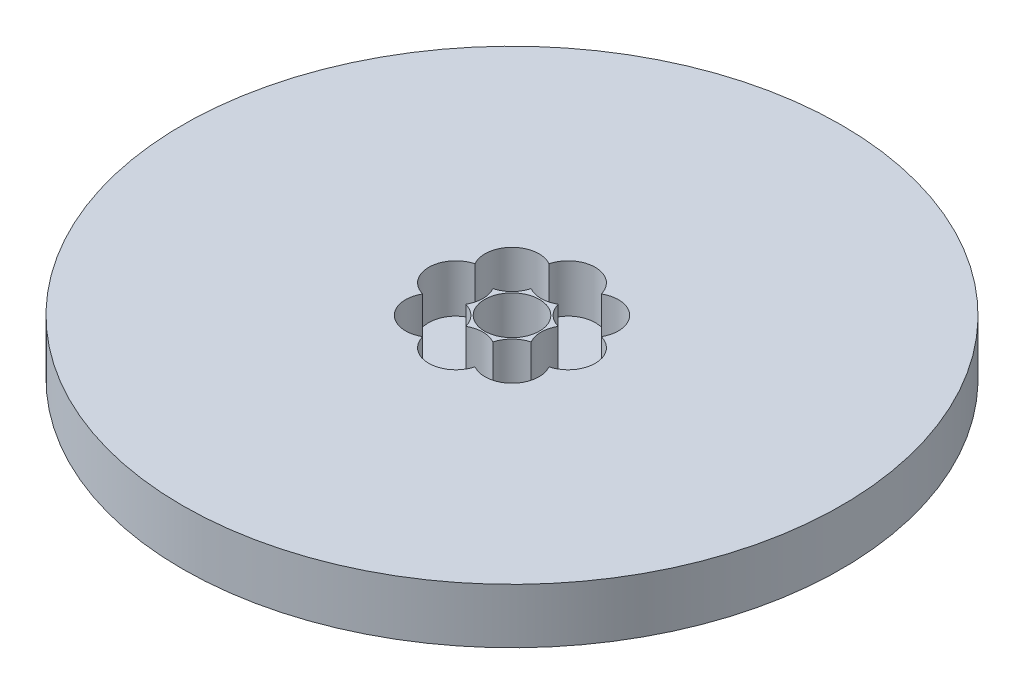
ISO-10303-21;
HEADER;
FILE_DESCRIPTION(('STEP AP214'),'2;1');
FILE_NAME('part.step','',(''),(''),'','','');
FILE_SCHEMA(('AUTOMOTIVE_DESIGN { 1 0 10303 214 1 1 1 1 }'));
ENDSEC;
DATA;
#1=APPLICATION_CONTEXT('core data for automotive mechanical design processes');
#2=APPLICATION_PROTOCOL_DEFINITION('international standard','automotive_design',2000,#1);
#3=PRODUCT_CONTEXT('',#1,'mechanical');
#4=PRODUCT('Part','Part','',(#3));
#5=PRODUCT_RELATED_PRODUCT_CATEGORY('part','',(#4));
#6=PRODUCT_DEFINITION_FORMATION('','',#4);
#7=PRODUCT_DEFINITION_CONTEXT('part definition',#1,'design');
#8=PRODUCT_DEFINITION('design','',#6,#7);
#9=PRODUCT_DEFINITION_SHAPE('','',#8);
#10=(LENGTH_UNIT() NAMED_UNIT(*) SI_UNIT(.MILLI.,.METRE.));
#11=(NAMED_UNIT(*) PLANE_ANGLE_UNIT() SI_UNIT($,.RADIAN.));
#12=(NAMED_UNIT(*) SI_UNIT($,.STERADIAN.) SOLID_ANGLE_UNIT());
#13=UNCERTAINTY_MEASURE_WITH_UNIT(LENGTH_MEASURE(1.E-05),#10,'distance_accuracy_value','');
#14=(GEOMETRIC_REPRESENTATION_CONTEXT(3) GLOBAL_UNCERTAINTY_ASSIGNED_CONTEXT((#13)) GLOBAL_UNIT_ASSIGNED_CONTEXT((#10,
#11,#12)) REPRESENTATION_CONTEXT('',''));
#15=CARTESIAN_POINT('',(0.,0.,0.));
#16=DIRECTION('',(0.,0.,1.));
#17=DIRECTION('',(1.,0.,0.));
#18=AXIS2_PLACEMENT_3D('',#15,#16,#17);
#19=CARTESIAN_POINT('',(0.,10.,0.));
#20=DIRECTION('',(0.,1.,0.));
#21=DIRECTION('',(0.,0.,1.));
#22=AXIS2_PLACEMENT_3D('',#19,#20,#21);
#23=PLANE('',#22);
#24=CARTESIAN_POINT('',(-7.22809447088071,10.,7.22809447088074));
#25=DIRECTION('',(0.,1.,0.));
#26=DIRECTION('',(0.707106781186549,0.,0.707106781186546));
#27=AXIS2_PLACEMENT_3D('',#24,#25,#26);
#28=CIRCLE('',#27,4.93118737523776);
#29=CARTESIAN_POINT('',(-2.46508521943811,10.,5.95124216917298));
#30=VERTEX_POINT('',#29);
#31=CARTESIAN_POINT('',(-5.95124216917297,10.,2.46508521943813));
#32=VERTEX_POINT('',#31);
#33=EDGE_CURVE('E249',#30,#32,#28,.T.);
#34=ORIENTED_EDGE('',*,*,#33,.F.);
#35=CARTESIAN_POINT('',(0.,10.,10.2220692308335));
#36=DIRECTION('',(0.,1.,0.));
#37=DIRECTION('',(1.,0.,0.));
#38=AXIS2_PLACEMENT_3D('',#35,#36,#37);
#39=CIRCLE('',#38,4.93118737523776);
#40=CARTESIAN_POINT('',(2.46508521943815,10.,5.95124216917296));
#41=VERTEX_POINT('',#40);
#42=EDGE_CURVE('E227',#41,#30,#39,.T.);
#43=ORIENTED_EDGE('',*,*,#42,.F.);
#44=CARTESIAN_POINT('',(7.22809447088076,10.,7.22809447088069));
#45=DIRECTION('',(0.,1.,0.));
#46=DIRECTION('',(0.707106781186544,0.,-0.707106781186551));
#47=AXIS2_PLACEMENT_3D('',#44,#45,#46);
#48=CIRCLE('',#47,4.93118737523776);
#49=CARTESIAN_POINT('',(5.95124216917295,10.,2.4650852194381));
#50=VERTEX_POINT('',#49);
#51=EDGE_CURVE('E202',#50,#41,#48,.T.);
#52=ORIENTED_EDGE('',*,*,#51,.F.);
#53=CARTESIAN_POINT('',(10.2220692308335,10.,0.));
#54=DIRECTION('',(0.,1.,0.));
#55=DIRECTION('',(0.,0.,-1.));
#56=AXIS2_PLACEMENT_3D('',#53,#54,#55);
#57=CIRCLE('',#56,4.93118737523776);
#58=CARTESIAN_POINT('',(5.95124216917299,10.,-2.46508521943816));
#59=VERTEX_POINT('',#58);
#60=EDGE_CURVE('E210',#59,#50,#57,.T.);
#61=ORIENTED_EDGE('',*,*,#60,.F.);
#62=CARTESIAN_POINT('',(7.22809447088066,10.,-7.22809447088079));
#63=DIRECTION('',(0.,1.,0.));
#64=DIRECTION('',(-0.707106781186554,0.,-0.707106781186541));
#65=AXIS2_PLACEMENT_3D('',#62,#63,#64);
#66=CIRCLE('',#65,4.93118737523776);
#67=CARTESIAN_POINT('',(2.46508521943807,10.,-5.951242169173));
#68=VERTEX_POINT('',#67);
#69=EDGE_CURVE('E190',#68,#59,#66,.T.);
#70=ORIENTED_EDGE('',*,*,#69,.F.);
#71=CARTESIAN_POINT('',(-1.07070491891453E-13,10.,-10.2220692308335));
#72=DIRECTION('',(0.,1.,0.));
#73=DIRECTION('',(-1.,0.,0.));
#74=AXIS2_PLACEMENT_3D('',#71,#72,#73);
#75=CIRCLE('',#74,4.93118737523776);
#76=CARTESIAN_POINT('',(-2.46508521943819,10.,-5.95124216917295));
#77=VERTEX_POINT('',#76);
#78=EDGE_CURVE('E164',#77,#68,#75,.T.);
#79=ORIENTED_EDGE('',*,*,#78,.F.);
#80=CARTESIAN_POINT('',(-7.22809447088081,10.,-7.22809447088064));
#81=DIRECTION('',(0.,1.,0.));
#82=DIRECTION('',(-0.707106781186539,0.,0.707106781186556));
#83=AXIS2_PLACEMENT_3D('',#80,#81,#82);
#84=CIRCLE('',#83,4.93118737523776);
#85=CARTESIAN_POINT('',(-5.95124216917293,10.,-2.46508521943806));
#86=VERTEX_POINT('',#85);
#87=EDGE_CURVE('E185',#86,#77,#84,.T.);
#88=ORIENTED_EDGE('',*,*,#87,.F.);
#89=CARTESIAN_POINT('',(-10.2220692308335,10.,0.));
#90=DIRECTION('',(0.,1.,0.));
#91=DIRECTION('',(0.,0.,1.));
#92=AXIS2_PLACEMENT_3D('',#89,#90,#91);
#93=CIRCLE('',#92,4.93118737523776);
#94=EDGE_CURVE('E262',#32,#86,#93,.T.);
#95=ORIENTED_EDGE('',*,*,#94,.F.);
#96=EDGE_LOOP('',(#34,#43,#52,#61,#70,#79,#88,#95));
#97=FACE_BOUND('',#96,.T.);
#98=CARTESIAN_POINT('',(0.,10.,0.));
#99=DIRECTION('',(0.,1.,0.));
#100=DIRECTION('',(0.,0.,1.));
#101=AXIS2_PLACEMENT_3D('',#98,#99,#100);
#102=CIRCLE('',#101,5.);
#103=CARTESIAN_POINT('',(0.,10.,5.));
#104=VERTEX_POINT('',#103);
#105=EDGE_CURVE('E270',#104,#104,#102,.T.);
#106=ORIENTED_EDGE('',*,*,#105,.F.);
#107=EDGE_LOOP('',(#106));
#108=FACE_BOUND('',#107,.T.);
#109=ADVANCED_FACE('F39',(#97,#108),#23,.T.);
#110=CARTESIAN_POINT('',(-10.2220692308335,1.27089405824533,0.));
#111=DIRECTION('',(0.,1.,0.));
#112=DIRECTION('',(0.,0.,1.));
#113=AXIS2_PLACEMENT_3D('',#110,#111,#112);
#114=CYLINDRICAL_SURFACE('',#113,4.93118737523776);
#115=CARTESIAN_POINT('',(-10.2220692308335,1.27089405824533,0.));
#116=DIRECTION('',(0.,1.,0.));
#117=DIRECTION('',(0.,0.,1.));
#118=AXIS2_PLACEMENT_3D('',#115,#116,#117);
#119=CIRCLE('',#118,4.93118737523776);
#120=CARTESIAN_POINT('',(-5.95124216917297,1.27089405824533,2.46508521943813));
#121=VERTEX_POINT('',#120);
#122=CARTESIAN_POINT('',(-5.95124216917293,1.27089405824533,-2.46508521943806));
#123=VERTEX_POINT('',#122);
#124=EDGE_CURVE('E259',#121,#123,#119,.T.);
#125=ORIENTED_EDGE('',*,*,#124,.F.);
#126=DIRECTION('',(0.,1.,0.));
#127=VECTOR('',#126,1.);
#128=CARTESIAN_POINT('',(-5.95124216917297,5.63544702912266,2.46508521943813));
#129=LINE('',#128,#127);
#130=EDGE_CURVE('E254',#121,#32,#129,.T.);
#131=ORIENTED_EDGE('',*,*,#130,.T.);
#132=ORIENTED_EDGE('',*,*,#94,.T.);
#133=DIRECTION('',(0.,1.,0.));
#134=VECTOR('',#133,1.);
#135=CARTESIAN_POINT('',(-5.95124216917293,5.63544702912266,-2.46508521943806));
#136=LINE('',#135,#134);
#137=EDGE_CURVE('E247',#86,#123,#136,.F.);
#138=ORIENTED_EDGE('',*,*,#137,.T.);
#139=EDGE_LOOP('',(#125,#131,#132,#138));
#140=FACE_BOUND('',#139,.T.);
#141=ADVANCED_FACE('F287',(#140),#114,.F.);
#142=CARTESIAN_POINT('',(0.,10.,0.));
#143=DIRECTION('',(0.,-1.,0.));
#144=DIRECTION('',(0.,0.,-1.));
#145=AXIS2_PLACEMENT_3D('',#142,#143,#144);
#146=CYLINDRICAL_SURFACE('',#145,60.);
#147=CARTESIAN_POINT('',(0.,10.,0.));
#148=DIRECTION('',(0.,1.,0.));
#149=DIRECTION('',(0.,0.,1.));
#150=AXIS2_PLACEMENT_3D('',#147,#148,#149);
#151=CIRCLE('',#150,60.);
#152=CARTESIAN_POINT('',(0.,10.,60.));
#153=VERTEX_POINT('',#152);
#154=EDGE_CURVE('E11',#153,#153,#151,.T.);
#155=ORIENTED_EDGE('',*,*,#154,.F.);
#156=EDGE_LOOP('',(#155));
#157=FACE_BOUND('',#156,.T.);
#158=CARTESIAN_POINT('',(0.,0.,0.));
#159=DIRECTION('',(0.,1.,0.));
#160=DIRECTION('',(0.,0.,1.));
#161=AXIS2_PLACEMENT_3D('',#158,#159,#160);
#162=CIRCLE('',#161,60.);
#163=CARTESIAN_POINT('',(0.,0.,60.));
#164=VERTEX_POINT('',#163);
#165=EDGE_CURVE('E43',#164,#164,#162,.T.);
#166=ORIENTED_EDGE('',*,*,#165,.T.);
#167=EDGE_LOOP('',(#166));
#168=FACE_BOUND('',#167,.T.);
#169=ADVANCED_FACE('F41',(#157,#168),#146,.T.);
#170=CARTESIAN_POINT('',(-11.4989215325412,10.,4.76300925144261));
#171=VERTEX_POINT('',#170);
#172=CARTESIAN_POINT('',(-4.76300925144257,10.,11.4989215325413));
#173=VERTEX_POINT('',#172);
#174=EDGE_CURVE('E243',#171,#173,#28,.T.);
#175=ORIENTED_EDGE('',*,*,#174,.F.);
#176=CARTESIAN_POINT('',(-11.4989215325414,10.,-4.76300925144258));
#177=VERTEX_POINT('',#176);
#178=EDGE_CURVE('E256',#177,#171,#93,.T.);
#179=ORIENTED_EDGE('',*,*,#178,.F.);
#180=CARTESIAN_POINT('',(-4.76300925144273,10.,-11.4989215325412));
#181=VERTEX_POINT('',#180);
#182=EDGE_CURVE('E179',#181,#177,#84,.T.);
#183=ORIENTED_EDGE('',*,*,#182,.F.);
#184=CARTESIAN_POINT('',(4.76300925144249,10.,-11.4989215325413));
#185=VERTEX_POINT('',#184);
#186=EDGE_CURVE('E171',#185,#181,#75,.T.);
#187=ORIENTED_EDGE('',*,*,#186,.F.);
#188=CARTESIAN_POINT('',(11.4989215325412,10.,-4.76300925144263));
#189=VERTEX_POINT('',#188);
#190=EDGE_CURVE('E192',#189,#185,#66,.T.);
#191=ORIENTED_EDGE('',*,*,#190,.F.);
#192=CARTESIAN_POINT('',(11.4989215325413,10.,4.76300925144259));
#193=VERTEX_POINT('',#192);
#194=EDGE_CURVE('E203',#193,#189,#57,.T.);
#195=ORIENTED_EDGE('',*,*,#194,.F.);
#196=CARTESIAN_POINT('',(4.76300925144265,10.,11.4989215325412));
#197=VERTEX_POINT('',#196);
#198=EDGE_CURVE('E212',#197,#193,#48,.T.);
#199=ORIENTED_EDGE('',*,*,#198,.F.);
#200=EDGE_CURVE('E225',#173,#197,#39,.T.);
#201=ORIENTED_EDGE('',*,*,#200,.F.);
#202=EDGE_LOOP('',(#175,#179,#183,#187,#191,#195,#199,#201));
#203=FACE_BOUND('',#202,.T.);
#204=ORIENTED_EDGE('',*,*,#154,.T.);
#205=EDGE_LOOP('',(#204));
#206=FACE_BOUND('',#205,.T.);
#207=ADVANCED_FACE('F288',(#203,#206),#23,.T.);
#208=CARTESIAN_POINT('',(0.,0.,0.));
#209=DIRECTION('',(0.,1.,0.));
#210=DIRECTION('',(0.,0.,1.));
#211=AXIS2_PLACEMENT_3D('',#208,#209,#210);
#212=PLANE('',#211);
#213=CARTESIAN_POINT('',(0.,0.,0.));
#214=DIRECTION('',(0.,1.,0.));
#215=DIRECTION('',(0.,0.,1.));
#216=AXIS2_PLACEMENT_3D('',#213,#214,#215);
#217=CIRCLE('',#216,5.);
#218=CARTESIAN_POINT('',(0.,0.,5.));
#219=VERTEX_POINT('',#218);
#220=EDGE_CURVE('E265',#219,#219,#217,.T.);
#221=ORIENTED_EDGE('',*,*,#220,.T.);
#222=EDGE_LOOP('',(#221));
#223=FACE_BOUND('',#222,.T.);
#224=ORIENTED_EDGE('',*,*,#165,.F.);
#225=EDGE_LOOP('',(#224));
#226=FACE_BOUND('',#225,.T.);
#227=ADVANCED_FACE('F272',(#223,#226),#212,.F.);
#228=CARTESIAN_POINT('',(0.,10.,0.));
#229=DIRECTION('',(0.,-1.,0.));
#230=DIRECTION('',(0.,0.,-1.));
#231=AXIS2_PLACEMENT_3D('',#228,#229,#230);
#232=CYLINDRICAL_SURFACE('',#231,5.);
#233=ORIENTED_EDGE('',*,*,#105,.T.);
#234=EDGE_LOOP('',(#233));
#235=FACE_BOUND('',#234,.T.);
#236=ORIENTED_EDGE('',*,*,#220,.F.);
#237=EDGE_LOOP('',(#236));
#238=FACE_BOUND('',#237,.T.);
#239=ADVANCED_FACE('F277',(#235,#238),#232,.F.);
#240=ORIENTED_EDGE('',*,*,#178,.T.);
#241=DIRECTION('',(0.,1.,0.));
#242=VECTOR('',#241,1.);
#243=CARTESIAN_POINT('',(-11.4989215325412,5.63544702912266,4.76300925144261));
#244=LINE('',#243,#242);
#245=CARTESIAN_POINT('',(-11.4989215325412,1.27089405824533,4.76300925144261));
#246=VERTEX_POINT('',#245);
#247=EDGE_CURVE('E65',#171,#246,#244,.F.);
#248=ORIENTED_EDGE('',*,*,#247,.T.);
#249=CARTESIAN_POINT('',(-11.4989215325414,1.27089405824533,-4.76300925144257));
#250=VERTEX_POINT('',#249);
#251=EDGE_CURVE('E263',#250,#246,#119,.T.);
#252=ORIENTED_EDGE('',*,*,#251,.F.);
#253=DIRECTION('',(0.,1.,0.));
#254=VECTOR('',#253,1.);
#255=CARTESIAN_POINT('',(-11.4989215325414,5.63544702912266,-4.76300925144257));
#256=LINE('',#255,#254);
#257=EDGE_CURVE('E177',#250,#177,#256,.T.);
#258=ORIENTED_EDGE('',*,*,#257,.T.);
#259=EDGE_LOOP('',(#240,#248,#252,#258));
#260=FACE_BOUND('',#259,.T.);
#261=ADVANCED_FACE('F279',(#260),#114,.F.);
#262=CARTESIAN_POINT('',(-10.2220692308335,1.27089405824533,0.));
#263=DIRECTION('',(0.,1.,0.));
#264=DIRECTION('',(0.,0.,1.));
#265=AXIS2_PLACEMENT_3D('',#262,#263,#264);
#266=PLANE('',#265);
#267=CARTESIAN_POINT('',(-7.22809447088081,1.27089405824533,-7.22809447088064));
#268=DIRECTION('',(0.,1.,0.));
#269=DIRECTION('',(-0.707106781186539,0.,0.707106781186556));
#270=AXIS2_PLACEMENT_3D('',#267,#268,#269);
#271=CIRCLE('',#270,4.93118737523776);
#272=CARTESIAN_POINT('',(-4.76300925144273,1.27089405824533,-11.4989215325412));
#273=VERTEX_POINT('',#272);
#274=EDGE_CURVE('E158',#273,#250,#271,.T.);
#275=ORIENTED_EDGE('',*,*,#274,.T.);
#276=ORIENTED_EDGE('',*,*,#251,.T.);
#277=CARTESIAN_POINT('',(-7.22809447088071,1.27089405824533,7.22809447088074));
#278=DIRECTION('',(0.,1.,0.));
#279=DIRECTION('',(0.707106781186549,0.,0.707106781186546));
#280=AXIS2_PLACEMENT_3D('',#277,#278,#279);
#281=CIRCLE('',#280,4.93118737523776);
#282=CARTESIAN_POINT('',(-4.76300925144257,1.27089405824533,11.4989215325413));
#283=VERTEX_POINT('',#282);
#284=EDGE_CURVE('E248',#246,#283,#281,.T.);
#285=ORIENTED_EDGE('',*,*,#284,.T.);
#286=CARTESIAN_POINT('',(0.,1.27089405824533,10.2220692308335));
#287=DIRECTION('',(0.,1.,0.));
#288=DIRECTION('',(1.,0.,0.));
#289=AXIS2_PLACEMENT_3D('',#286,#287,#288);
#290=CIRCLE('',#289,4.93118737523776);
#291=CARTESIAN_POINT('',(4.76300925144265,1.27089405824533,11.4989215325412));
#292=VERTEX_POINT('',#291);
#293=EDGE_CURVE('E230',#283,#292,#290,.T.);
#294=ORIENTED_EDGE('',*,*,#293,.T.);
#295=CARTESIAN_POINT('',(7.22809447088076,1.27089405824533,7.22809447088069));
#296=DIRECTION('',(0.,1.,0.));
#297=DIRECTION('',(0.707106781186544,0.,-0.707106781186551));
#298=AXIS2_PLACEMENT_3D('',#295,#296,#297);
#299=CIRCLE('',#298,4.93118737523776);
#300=CARTESIAN_POINT('',(11.4989215325413,1.27089405824533,4.76300925144259));
#301=VERTEX_POINT('',#300);
#302=EDGE_CURVE('E209',#292,#301,#299,.T.);
#303=ORIENTED_EDGE('',*,*,#302,.T.);
#304=CARTESIAN_POINT('',(10.2220692308335,1.27089405824533,0.));
#305=DIRECTION('',(0.,1.,0.));
#306=DIRECTION('',(0.,0.,-1.));
#307=AXIS2_PLACEMENT_3D('',#304,#305,#306);
#308=CIRCLE('',#307,4.93118737523776);
#309=CARTESIAN_POINT('',(11.4989215325412,1.27089405824533,-4.76300925144263));
#310=VERTEX_POINT('',#309);
#311=EDGE_CURVE('E206',#301,#310,#308,.T.);
#312=ORIENTED_EDGE('',*,*,#311,.T.);
#313=CARTESIAN_POINT('',(7.22809447088066,1.27089405824533,-7.22809447088079));
#314=DIRECTION('',(0.,1.,0.));
#315=DIRECTION('',(-0.707106781186554,0.,-0.707106781186541));
#316=AXIS2_PLACEMENT_3D('',#313,#314,#315);
#317=CIRCLE('',#316,4.93118737523776);
#318=CARTESIAN_POINT('',(4.76300925144249,1.27089405824533,-11.4989215325413));
#319=VERTEX_POINT('',#318);
#320=EDGE_CURVE('E161',#310,#319,#317,.T.);
#321=ORIENTED_EDGE('',*,*,#320,.T.);
#322=CARTESIAN_POINT('',(-1.07070491891453E-13,1.27089405824533,-10.2220692308335));
#323=DIRECTION('',(0.,1.,0.));
#324=DIRECTION('',(-1.,0.,0.));
#325=AXIS2_PLACEMENT_3D('',#322,#323,#324);
#326=CIRCLE('',#325,4.93118737523776);
#327=EDGE_CURVE('E155',#319,#273,#326,.T.);
#328=ORIENTED_EDGE('',*,*,#327,.T.);
#329=EDGE_LOOP('',(#275,#276,#285,#294,#303,#312,#321,#328));
#330=FACE_BOUND('',#329,.T.);
#331=ORIENTED_EDGE('',*,*,#124,.T.);
#332=CARTESIAN_POINT('',(-2.46508521943819,1.27089405824533,-5.95124216917295));
#333=VERTEX_POINT('',#332);
#334=EDGE_CURVE('E53',#123,#333,#271,.T.);
#335=ORIENTED_EDGE('',*,*,#334,.T.);
#336=CARTESIAN_POINT('',(2.46508521943807,1.27089405824533,-5.951242169173));
#337=VERTEX_POINT('',#336);
#338=EDGE_CURVE('E163',#333,#337,#326,.T.);
#339=ORIENTED_EDGE('',*,*,#338,.T.);
#340=CARTESIAN_POINT('',(5.95124216917299,1.27089405824533,-2.46508521943816));
#341=VERTEX_POINT('',#340);
#342=EDGE_CURVE('E195',#337,#341,#317,.T.);
#343=ORIENTED_EDGE('',*,*,#342,.T.);
#344=CARTESIAN_POINT('',(5.95124216917295,1.27089405824533,2.4650852194381));
#345=VERTEX_POINT('',#344);
#346=EDGE_CURVE('E205',#341,#345,#308,.T.);
#347=ORIENTED_EDGE('',*,*,#346,.T.);
#348=CARTESIAN_POINT('',(2.46508521943815,1.27089405824533,5.95124216917296));
#349=VERTEX_POINT('',#348);
#350=EDGE_CURVE('E213',#345,#349,#299,.T.);
#351=ORIENTED_EDGE('',*,*,#350,.T.);
#352=CARTESIAN_POINT('',(-2.46508521943811,1.27089405824533,5.95124216917298));
#353=VERTEX_POINT('',#352);
#354=EDGE_CURVE('E224',#349,#353,#290,.T.);
#355=ORIENTED_EDGE('',*,*,#354,.T.);
#356=EDGE_CURVE('E244',#353,#121,#281,.T.);
#357=ORIENTED_EDGE('',*,*,#356,.T.);
#358=EDGE_LOOP('',(#331,#335,#339,#343,#347,#351,#355,#357));
#359=FACE_BOUND('',#358,.T.);
#360=ADVANCED_FACE('F152',(#330,#359),#266,.T.);
#361=CARTESIAN_POINT('',(-7.22809447088071,1.27089405824533,7.22809447088074));
#362=DIRECTION('',(0.,1.,0.));
#363=DIRECTION('',(0.,0.,1.));
#364=AXIS2_PLACEMENT_3D('',#361,#362,#363);
#365=CYLINDRICAL_SURFACE('',#364,4.93118737523776);
#366=ORIENTED_EDGE('',*,*,#356,.F.);
#367=DIRECTION('',(0.,1.,0.));
#368=VECTOR('',#367,1.);
#369=CARTESIAN_POINT('',(-2.46508521943811,5.63544702912266,5.95124216917298));
#370=LINE('',#369,#368);
#371=EDGE_CURVE('E245',#353,#30,#370,.T.);
#372=ORIENTED_EDGE('',*,*,#371,.T.);
#373=ORIENTED_EDGE('',*,*,#33,.T.);
#374=ORIENTED_EDGE('',*,*,#130,.F.);
#375=EDGE_LOOP('',(#366,#372,#373,#374));
#376=FACE_BOUND('',#375,.T.);
#377=ADVANCED_FACE('F375',(#376),#365,.F.);
#378=ORIENTED_EDGE('',*,*,#174,.T.);
#379=DIRECTION('',(0.,1.,0.));
#380=VECTOR('',#379,1.);
#381=CARTESIAN_POINT('',(-4.76300925144257,5.63544702912266,11.4989215325413));
#382=LINE('',#381,#380);
#383=EDGE_CURVE('E239',#173,#283,#382,.F.);
#384=ORIENTED_EDGE('',*,*,#383,.T.);
#385=ORIENTED_EDGE('',*,*,#284,.F.);
#386=ORIENTED_EDGE('',*,*,#247,.F.);
#387=EDGE_LOOP('',(#378,#384,#385,#386));
#388=FACE_BOUND('',#387,.T.);
#389=ADVANCED_FACE('F312',(#388),#365,.F.);
#390=CARTESIAN_POINT('',(-7.22809447088081,1.27089405824533,-7.22809447088064));
#391=DIRECTION('',(0.,1.,0.));
#392=DIRECTION('',(0.,0.,1.));
#393=AXIS2_PLACEMENT_3D('',#390,#391,#392);
#394=CYLINDRICAL_SURFACE('',#393,4.93118737523776);
#395=ORIENTED_EDGE('',*,*,#274,.F.);
#396=DIRECTION('',(0.,1.,0.));
#397=VECTOR('',#396,1.);
#398=CARTESIAN_POINT('',(-4.76300925144273,5.63544702912266,-11.4989215325412));
#399=LINE('',#398,#397);
#400=EDGE_CURVE('E169',#181,#273,#399,.F.);
#401=ORIENTED_EDGE('',*,*,#400,.F.);
#402=ORIENTED_EDGE('',*,*,#182,.T.);
#403=ORIENTED_EDGE('',*,*,#257,.F.);
#404=EDGE_LOOP('',(#395,#401,#402,#403));
#405=FACE_BOUND('',#404,.T.);
#406=ADVANCED_FACE('F176',(#405),#394,.F.);
#407=ORIENTED_EDGE('',*,*,#87,.T.);
#408=DIRECTION('',(0.,1.,0.));
#409=VECTOR('',#408,1.);
#410=CARTESIAN_POINT('',(-2.46508521943819,5.63544702912266,-5.95124216917295));
#411=LINE('',#410,#409);
#412=EDGE_CURVE('E173',#333,#77,#411,.T.);
#413=ORIENTED_EDGE('',*,*,#412,.F.);
#414=ORIENTED_EDGE('',*,*,#334,.F.);
#415=ORIENTED_EDGE('',*,*,#137,.F.);
#416=EDGE_LOOP('',(#407,#413,#414,#415));
#417=FACE_BOUND('',#416,.T.);
#418=ADVANCED_FACE('F355',(#417),#394,.F.);
#419=CARTESIAN_POINT('',(0.,1.27089405824533,10.2220692308335));
#420=DIRECTION('',(0.,1.,0.));
#421=DIRECTION('',(0.,0.,1.));
#422=AXIS2_PLACEMENT_3D('',#419,#420,#421);
#423=CYLINDRICAL_SURFACE('',#422,4.93118737523776);
#424=ORIENTED_EDGE('',*,*,#354,.F.);
#425=DIRECTION('',(0.,1.,0.));
#426=VECTOR('',#425,1.);
#427=CARTESIAN_POINT('',(2.46508521943815,5.63544702912266,5.95124216917296));
#428=LINE('',#427,#426);
#429=EDGE_CURVE('E218',#349,#41,#428,.T.);
#430=ORIENTED_EDGE('',*,*,#429,.T.);
#431=ORIENTED_EDGE('',*,*,#42,.T.);
#432=ORIENTED_EDGE('',*,*,#371,.F.);
#433=EDGE_LOOP('',(#424,#430,#431,#432));
#434=FACE_BOUND('',#433,.T.);
#435=ADVANCED_FACE('F343',(#434),#423,.F.);
#436=CARTESIAN_POINT('',(7.22809447088066,1.27089405824533,-7.22809447088079));
#437=DIRECTION('',(0.,1.,0.));
#438=DIRECTION('',(0.,0.,1.));
#439=AXIS2_PLACEMENT_3D('',#436,#437,#438);
#440=CYLINDRICAL_SURFACE('',#439,4.93118737523776);
#441=DIRECTION('',(0.,1.,0.));
#442=VECTOR('',#441,1.);
#443=CARTESIAN_POINT('',(2.46508521943807,5.63544702912266,-5.951242169173));
#444=LINE('',#443,#442);
#445=EDGE_CURVE('E240',#337,#68,#444,.T.);
#446=ORIENTED_EDGE('',*,*,#445,.T.);
#447=ORIENTED_EDGE('',*,*,#69,.T.);
#448=DIRECTION('',(0.,1.,0.));
#449=VECTOR('',#448,1.);
#450=CARTESIAN_POINT('',(5.95124216917299,5.63544702912266,-2.46508521943816));
#451=LINE('',#450,#449);
#452=EDGE_CURVE('E196',#341,#59,#451,.T.);
#453=ORIENTED_EDGE('',*,*,#452,.F.);
#454=ORIENTED_EDGE('',*,*,#342,.F.);
#455=EDGE_LOOP('',(#446,#447,#453,#454));
#456=FACE_BOUND('',#455,.T.);
#457=ADVANCED_FACE('F334',(#456),#440,.F.);
#458=CARTESIAN_POINT('',(7.22809447088076,1.27089405824533,7.22809447088069));
#459=DIRECTION('',(0.,1.,0.));
#460=DIRECTION('',(0.,0.,1.));
#461=AXIS2_PLACEMENT_3D('',#458,#459,#460);
#462=CYLINDRICAL_SURFACE('',#461,4.93118737523776);
#463=DIRECTION('',(0.,1.,0.));
#464=VECTOR('',#463,1.);
#465=CARTESIAN_POINT('',(5.95124216917295,5.63544702912266,2.4650852194381));
#466=LINE('',#465,#464);
#467=EDGE_CURVE('E232',#345,#50,#466,.T.);
#468=ORIENTED_EDGE('',*,*,#467,.T.);
#469=ORIENTED_EDGE('',*,*,#51,.T.);
#470=ORIENTED_EDGE('',*,*,#429,.F.);
#471=ORIENTED_EDGE('',*,*,#350,.F.);
#472=EDGE_LOOP('',(#468,#469,#470,#471));
#473=FACE_BOUND('',#472,.T.);
#474=ADVANCED_FACE('F342',(#473),#462,.F.);
#475=ORIENTED_EDGE('',*,*,#200,.T.);
#476=DIRECTION('',(0.,1.,0.));
#477=VECTOR('',#476,1.);
#478=CARTESIAN_POINT('',(4.76300925144265,5.63544702912266,11.4989215325412));
#479=LINE('',#478,#477);
#480=EDGE_CURVE('E215',#197,#292,#479,.F.);
#481=ORIENTED_EDGE('',*,*,#480,.T.);
#482=ORIENTED_EDGE('',*,*,#293,.F.);
#483=ORIENTED_EDGE('',*,*,#383,.F.);
#484=EDGE_LOOP('',(#475,#481,#482,#483));
#485=FACE_BOUND('',#484,.T.);
#486=ADVANCED_FACE('F320',(#485),#423,.F.);
#487=DIRECTION('',(0.,1.,0.));
#488=VECTOR('',#487,1.);
#489=CARTESIAN_POINT('',(11.4989215325413,5.63544702912266,4.76300925144259));
#490=LINE('',#489,#488);
#491=EDGE_CURVE('E226',#193,#301,#490,.F.);
#492=ORIENTED_EDGE('',*,*,#491,.T.);
#493=ORIENTED_EDGE('',*,*,#302,.F.);
#494=ORIENTED_EDGE('',*,*,#480,.F.);
#495=ORIENTED_EDGE('',*,*,#198,.T.);
#496=EDGE_LOOP('',(#492,#493,#494,#495));
#497=FACE_BOUND('',#496,.T.);
#498=ADVANCED_FACE('F321',(#497),#462,.F.);
#499=CARTESIAN_POINT('',(10.2220692308335,1.27089405824533,0.));
#500=DIRECTION('',(0.,1.,0.));
#501=DIRECTION('',(0.,0.,1.));
#502=AXIS2_PLACEMENT_3D('',#499,#500,#501);
#503=CYLINDRICAL_SURFACE('',#502,4.93118737523776);
#504=ORIENTED_EDGE('',*,*,#346,.F.);
#505=ORIENTED_EDGE('',*,*,#452,.T.);
#506=ORIENTED_EDGE('',*,*,#60,.T.);
#507=ORIENTED_EDGE('',*,*,#467,.F.);
#508=EDGE_LOOP('',(#504,#505,#506,#507));
#509=FACE_BOUND('',#508,.T.);
#510=ADVANCED_FACE('F339',(#509),#503,.F.);
#511=ORIENTED_EDGE('',*,*,#194,.T.);
#512=DIRECTION('',(0.,1.,0.));
#513=VECTOR('',#512,1.);
#514=CARTESIAN_POINT('',(11.4989215325412,5.63544702912266,-4.76300925144263));
#515=LINE('',#514,#513);
#516=EDGE_CURVE('E191',#189,#310,#515,.F.);
#517=ORIENTED_EDGE('',*,*,#516,.T.);
#518=ORIENTED_EDGE('',*,*,#311,.F.);
#519=ORIENTED_EDGE('',*,*,#491,.F.);
#520=EDGE_LOOP('',(#511,#517,#518,#519));
#521=FACE_BOUND('',#520,.T.);
#522=ADVANCED_FACE('F324',(#521),#503,.F.);
#523=DIRECTION('',(0.,1.,0.));
#524=VECTOR('',#523,1.);
#525=CARTESIAN_POINT('',(4.76300925144249,5.63544702912266,-11.4989215325413));
#526=LINE('',#525,#524);
#527=EDGE_CURVE('E234',#185,#319,#526,.F.);
#528=ORIENTED_EDGE('',*,*,#527,.T.);
#529=ORIENTED_EDGE('',*,*,#320,.F.);
#530=ORIENTED_EDGE('',*,*,#516,.F.);
#531=ORIENTED_EDGE('',*,*,#190,.T.);
#532=EDGE_LOOP('',(#528,#529,#530,#531));
#533=FACE_BOUND('',#532,.T.);
#534=ADVANCED_FACE('F328',(#533),#440,.F.);
#535=CARTESIAN_POINT('',(-1.07070491891453E-13,1.27089405824533,-10.2220692308335));
#536=DIRECTION('',(0.,1.,0.));
#537=DIRECTION('',(0.,0.,1.));
#538=AXIS2_PLACEMENT_3D('',#535,#536,#537);
#539=CYLINDRICAL_SURFACE('',#538,4.93118737523776);
#540=ORIENTED_EDGE('',*,*,#338,.F.);
#541=ORIENTED_EDGE('',*,*,#412,.T.);
#542=ORIENTED_EDGE('',*,*,#78,.T.);
#543=ORIENTED_EDGE('',*,*,#445,.F.);
#544=EDGE_LOOP('',(#540,#541,#542,#543));
#545=FACE_BOUND('',#544,.T.);
#546=ADVANCED_FACE('F332',(#545),#539,.F.);
#547=ORIENTED_EDGE('',*,*,#186,.T.);
#548=ORIENTED_EDGE('',*,*,#400,.T.);
#549=ORIENTED_EDGE('',*,*,#327,.F.);
#550=ORIENTED_EDGE('',*,*,#527,.F.);
#551=EDGE_LOOP('',(#547,#548,#549,#550));
#552=FACE_BOUND('',#551,.T.);
#553=ADVANCED_FACE('F166',(#552),#539,.F.);
#554=CLOSED_SHELL('',(#109,#141,#169,#207,#227,#239,#261,#360,#377,#389,#406,#418,#435,#457,
#474,#486,#498,#510,#522,#534,#546,#553));
#555=MANIFOLD_SOLID_BREP('B2',#554);
#556=ADVANCED_BREP_SHAPE_REPRESENTATION('',(#18,#555),#14);
#557=SHAPE_DEFINITION_REPRESENTATION(#9,#556);
ENDSEC;
END-ISO-10303-21;
